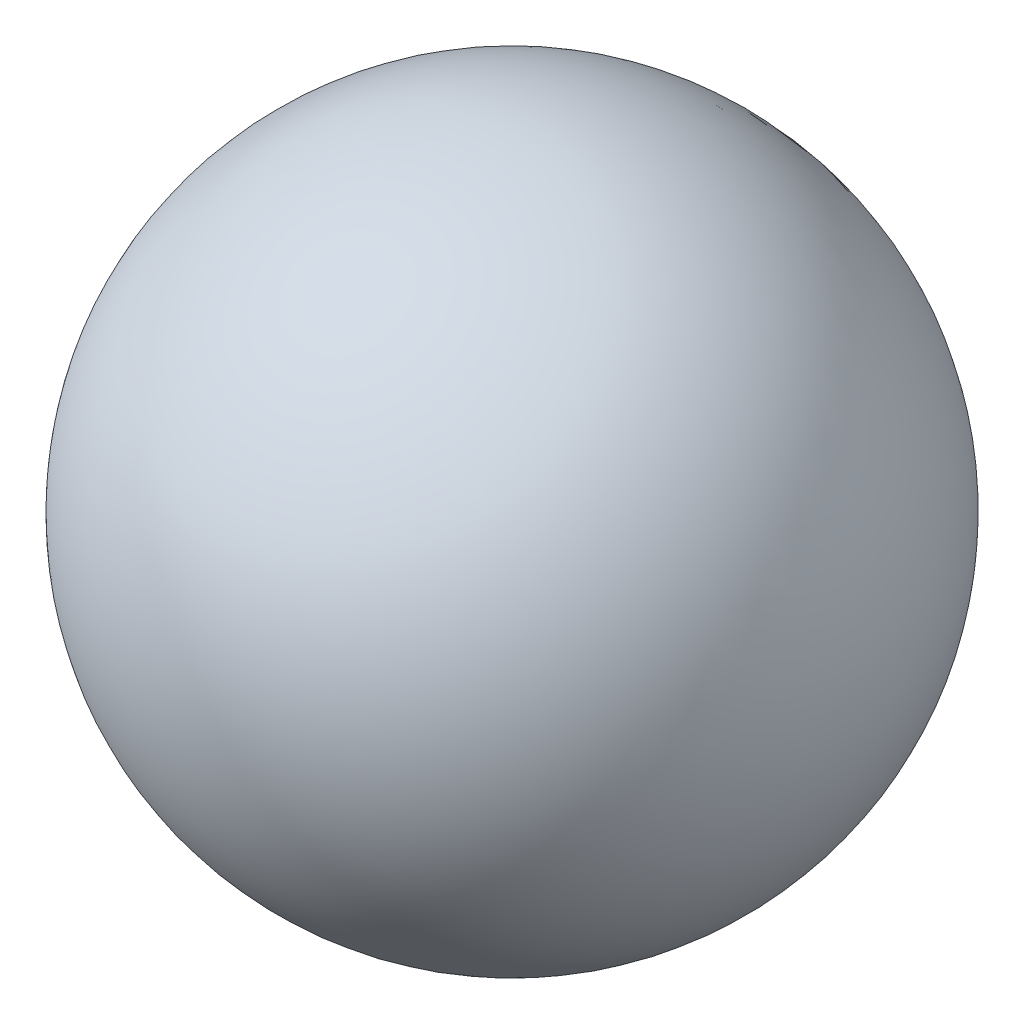
ISO-10303-21;
HEADER;
FILE_DESCRIPTION(('STEP AP214'),'2;1');
FILE_NAME('part.step','',(''),(''),'','','');
FILE_SCHEMA(('AUTOMOTIVE_DESIGN { 1 0 10303 214 1 1 1 1 }'));
ENDSEC;
DATA;
#1=APPLICATION_CONTEXT('core data for automotive mechanical design processes');
#2=APPLICATION_PROTOCOL_DEFINITION('international standard','automotive_design',2000,#1);
#3=PRODUCT_CONTEXT('',#1,'mechanical');
#4=PRODUCT('Part','Part','',(#3));
#5=PRODUCT_RELATED_PRODUCT_CATEGORY('part','',(#4));
#6=PRODUCT_DEFINITION_FORMATION('','',#4);
#7=PRODUCT_DEFINITION_CONTEXT('part definition',#1,'design');
#8=PRODUCT_DEFINITION('design','',#6,#7);
#9=PRODUCT_DEFINITION_SHAPE('','',#8);
#10=(LENGTH_UNIT() NAMED_UNIT(*) SI_UNIT(.MILLI.,.METRE.));
#11=(NAMED_UNIT(*) PLANE_ANGLE_UNIT() SI_UNIT($,.RADIAN.));
#12=(NAMED_UNIT(*) SI_UNIT($,.STERADIAN.) SOLID_ANGLE_UNIT());
#13=UNCERTAINTY_MEASURE_WITH_UNIT(LENGTH_MEASURE(1.E-05),#10,'distance_accuracy_value','');
#14=(GEOMETRIC_REPRESENTATION_CONTEXT(3) GLOBAL_UNCERTAINTY_ASSIGNED_CONTEXT((#13)) GLOBAL_UNIT_ASSIGNED_CONTEXT((#10,
#11,#12)) REPRESENTATION_CONTEXT('',''));
#15=CARTESIAN_POINT('',(0.,0.,0.));
#16=DIRECTION('',(0.,0.,1.));
#17=DIRECTION('',(1.,0.,0.));
#18=AXIS2_PLACEMENT_3D('',#15,#16,#17);
#19=CARTESIAN_POINT('',(64.16,-35.5315924589284,-59.5945184252094));
#20=DIRECTION('',(0.,-0.512108044606437,-0.85892103865802));
#21=DIRECTION('',(0.173648177666933,0.845872098095716,-0.504327972708341));
#22=AXIS2_PLACEMENT_3D('',#19,#20,#21);
#23=SPHERICAL_SURFACE('',#22,7.15);
#24=CARTESIAN_POINT('',(64.16,-31.8700199399924,-53.4532329988046));
#25=VERTEX_POINT('',#24);
#26=VERTEX_LOOP('',#25);
#27=FACE_BOUND('',#26,.T.);
#28=CARTESIAN_POINT('',(64.16,-39.1931649778644,-65.7358038516142));
#29=VERTEX_POINT('',#28);
#30=VERTEX_LOOP('',#29);
#31=FACE_BOUND('',#30,.T.);
#32=ADVANCED_FACE('F15',(#27,#31),#23,.T.);
#33=CLOSED_SHELL('',(#32));
#34=MANIFOLD_SOLID_BREP('B1',#33);
#35=ADVANCED_BREP_SHAPE_REPRESENTATION('',(#18,#34),#14);
#36=SHAPE_DEFINITION_REPRESENTATION(#9,#35);
ENDSEC;
END-ISO-10303-21;
